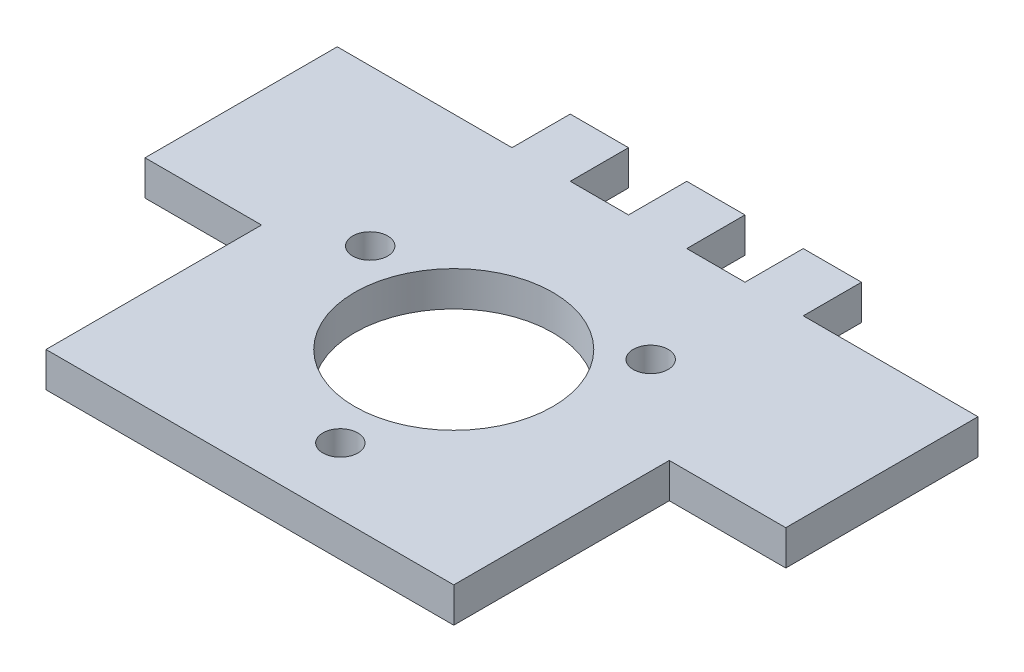
ISO-10303-21;
HEADER;
FILE_DESCRIPTION(('STEP AP214'),'2;1');
FILE_NAME('part.step','',(''),(''),'','','');
FILE_SCHEMA(('AUTOMOTIVE_DESIGN { 1 0 10303 214 1 1 1 1 }'));
ENDSEC;
DATA;
#1=APPLICATION_CONTEXT('core data for automotive mechanical design processes');
#2=APPLICATION_PROTOCOL_DEFINITION('international standard','automotive_design',2000,#1);
#3=PRODUCT_CONTEXT('',#1,'mechanical');
#4=PRODUCT('Part','Part','',(#3));
#5=PRODUCT_RELATED_PRODUCT_CATEGORY('part','',(#4));
#6=PRODUCT_DEFINITION_FORMATION('','',#4);
#7=PRODUCT_DEFINITION_CONTEXT('part definition',#1,'design');
#8=PRODUCT_DEFINITION('design','',#6,#7);
#9=PRODUCT_DEFINITION_SHAPE('','',#8);
#10=(LENGTH_UNIT() NAMED_UNIT(*) SI_UNIT(.MILLI.,.METRE.));
#11=(NAMED_UNIT(*) PLANE_ANGLE_UNIT() SI_UNIT($,.RADIAN.));
#12=(NAMED_UNIT(*) SI_UNIT($,.STERADIAN.) SOLID_ANGLE_UNIT());
#13=UNCERTAINTY_MEASURE_WITH_UNIT(LENGTH_MEASURE(1.E-05),#10,'distance_accuracy_value','');
#14=(GEOMETRIC_REPRESENTATION_CONTEXT(3) GLOBAL_UNCERTAINTY_ASSIGNED_CONTEXT((#13)) GLOBAL_UNIT_ASSIGNED_CONTEXT((#10,
#11,#12)) REPRESENTATION_CONTEXT('',''));
#15=CARTESIAN_POINT('',(0.,0.,0.));
#16=DIRECTION('',(0.,0.,1.));
#17=DIRECTION('',(1.,0.,0.));
#18=AXIS2_PLACEMENT_3D('',#15,#16,#17);
#19=CARTESIAN_POINT('',(-17.5,3.,-17.5));
#20=DIRECTION('',(1.,0.,0.));
#21=DIRECTION('',(0.,0.,-1.));
#22=AXIS2_PLACEMENT_3D('',#19,#20,#21);
#23=PLANE('',#22);
#24=DIRECTION('',(0.,1.,0.));
#25=VECTOR('',#24,1.);
#26=CARTESIAN_POINT('',(-17.5,-19.2937813815747,-0.999999999999997));
#27=LINE('',#26,#25);
#28=CARTESIAN_POINT('',(-17.5,0.,-0.999999999999997));
#29=VERTEX_POINT('',#28);
#30=CARTESIAN_POINT('',(-17.5,3.,-0.999999999999997));
#31=VERTEX_POINT('',#30);
#32=EDGE_CURVE('E57',#29,#31,#27,.T.);
#33=ORIENTED_EDGE('',*,*,#32,.F.);
#34=DIRECTION('',(0.,0.,1.));
#35=VECTOR('',#34,1.);
#36=CARTESIAN_POINT('',(-17.5,0.,-17.5));
#37=LINE('',#36,#35);
#38=CARTESIAN_POINT('',(-17.5,0.,17.5));
#39=VERTEX_POINT('',#38);
#40=EDGE_CURVE('E293',#29,#39,#37,.T.);
#41=ORIENTED_EDGE('',*,*,#40,.T.);
#42=DIRECTION('',(0.,-1.,0.));
#43=VECTOR('',#42,1.);
#44=CARTESIAN_POINT('',(-17.5,3.,17.5));
#45=LINE('',#44,#43);
#46=CARTESIAN_POINT('',(-17.5,3.,17.5));
#47=VERTEX_POINT('',#46);
#48=EDGE_CURVE('E11',#47,#39,#45,.T.);
#49=ORIENTED_EDGE('',*,*,#48,.F.);
#50=DIRECTION('',(0.,0.,1.));
#51=VECTOR('',#50,1.);
#52=CARTESIAN_POINT('',(-17.5,3.,-17.5));
#53=LINE('',#52,#51);
#54=EDGE_CURVE('E219',#31,#47,#53,.T.);
#55=ORIENTED_EDGE('',*,*,#54,.F.);
#56=EDGE_LOOP('',(#33,#41,#49,#55));
#57=FACE_BOUND('',#56,.T.);
#58=ADVANCED_FACE('F33',(#57),#23,.F.);
#59=CARTESIAN_POINT('',(-17.5,3.,-17.5));
#60=DIRECTION('',(0.,0.,1.));
#61=DIRECTION('',(1.,0.,0.));
#62=AXIS2_PLACEMENT_3D('',#59,#60,#61);
#63=PLANE('',#62);
#64=DIRECTION('',(-1.,0.,0.));
#65=VECTOR('',#64,1.);
#66=CARTESIAN_POINT('',(-17.5,3.,-17.5));
#67=LINE('',#66,#65);
#68=CARTESIAN_POINT('',(7.49999999999999,3.,-17.5));
#69=VERTEX_POINT('',#68);
#70=CARTESIAN_POINT('',(2.5,3.,-17.5));
#71=VERTEX_POINT('',#70);
#72=EDGE_CURVE('E258',#69,#71,#67,.T.);
#73=ORIENTED_EDGE('',*,*,#72,.F.);
#74=DIRECTION('',(0.,1.,0.));
#75=VECTOR('',#74,1.);
#76=CARTESIAN_POINT('',(7.49999999999999,0.,-17.5));
#77=LINE('',#76,#75);
#78=CARTESIAN_POINT('',(7.49999999999999,0.,-17.5));
#79=VERTEX_POINT('',#78);
#80=EDGE_CURVE('E378',#79,#69,#77,.T.);
#81=ORIENTED_EDGE('',*,*,#80,.F.);
#82=DIRECTION('',(-1.,0.,0.));
#83=VECTOR('',#82,1.);
#84=CARTESIAN_POINT('',(-17.5,0.,-17.5));
#85=LINE('',#84,#83);
#86=CARTESIAN_POINT('',(2.5,0.,-17.5));
#87=VERTEX_POINT('',#86);
#88=EDGE_CURVE('E253',#79,#87,#85,.T.);
#89=ORIENTED_EDGE('',*,*,#88,.T.);
#90=DIRECTION('',(0.,1.,0.));
#91=VECTOR('',#90,1.);
#92=CARTESIAN_POINT('',(2.49999999999999,0.,-17.5));
#93=LINE('',#92,#91);
#94=EDGE_CURVE('E341',#87,#71,#93,.T.);
#95=ORIENTED_EDGE('',*,*,#94,.T.);
#96=EDGE_LOOP('',(#73,#81,#89,#95));
#97=FACE_BOUND('',#96,.T.);
#98=ADVANCED_FACE('F375',(#97),#63,.F.);
#99=CARTESIAN_POINT('',(-2.50000000000001,3.,-17.5));
#100=VERTEX_POINT('',#99);
#101=CARTESIAN_POINT('',(-7.50000000000001,3.,-17.5));
#102=VERTEX_POINT('',#101);
#103=EDGE_CURVE('E256',#100,#102,#67,.T.);
#104=ORIENTED_EDGE('',*,*,#103,.F.);
#105=DIRECTION('',(0.,1.,0.));
#106=VECTOR('',#105,1.);
#107=CARTESIAN_POINT('',(-2.50000000000001,0.,-17.5));
#108=LINE('',#107,#106);
#109=CARTESIAN_POINT('',(-2.50000000000001,0.,-17.5));
#110=VERTEX_POINT('',#109);
#111=EDGE_CURVE('E348',#110,#100,#108,.T.);
#112=ORIENTED_EDGE('',*,*,#111,.F.);
#113=CARTESIAN_POINT('',(-7.50000000000001,0.,-17.5));
#114=VERTEX_POINT('',#113);
#115=EDGE_CURVE('E250',#110,#114,#85,.T.);
#116=ORIENTED_EDGE('',*,*,#115,.T.);
#117=DIRECTION('',(0.,1.,0.));
#118=VECTOR('',#117,1.);
#119=CARTESIAN_POINT('',(-7.50000000000001,0.,-17.5));
#120=LINE('',#119,#118);
#121=EDGE_CURVE('E303',#114,#102,#120,.T.);
#122=ORIENTED_EDGE('',*,*,#121,.T.);
#123=EDGE_LOOP('',(#104,#112,#116,#122));
#124=FACE_BOUND('',#123,.T.);
#125=ADVANCED_FACE('F418',(#124),#63,.F.);
#126=DIRECTION('',(0.,1.,0.));
#127=VECTOR('',#126,1.);
#128=CARTESIAN_POINT('',(-12.5,0.,-17.5));
#129=LINE('',#128,#127);
#130=CARTESIAN_POINT('',(-12.5,0.,-17.5));
#131=VERTEX_POINT('',#130);
#132=CARTESIAN_POINT('',(-12.5,3.,-17.5));
#133=VERTEX_POINT('',#132);
#134=EDGE_CURVE('E316',#131,#133,#129,.T.);
#135=ORIENTED_EDGE('',*,*,#134,.F.);
#136=CARTESIAN_POINT('',(-27.5,0.,-17.5));
#137=VERTEX_POINT('',#136);
#138=EDGE_CURVE('E233',#131,#137,#85,.T.);
#139=ORIENTED_EDGE('',*,*,#138,.T.);
#140=DIRECTION('',(0.,1.,0.));
#141=VECTOR('',#140,1.);
#142=CARTESIAN_POINT('',(-27.5,-19.2937813815747,-17.5));
#143=LINE('',#142,#141);
#144=CARTESIAN_POINT('',(-27.5,3.,-17.5));
#145=VERTEX_POINT('',#144);
#146=EDGE_CURVE('E224',#137,#145,#143,.T.);
#147=ORIENTED_EDGE('',*,*,#146,.T.);
#148=EDGE_CURVE('E259',#133,#145,#67,.T.);
#149=ORIENTED_EDGE('',*,*,#148,.F.);
#150=EDGE_LOOP('',(#135,#139,#147,#149));
#151=FACE_BOUND('',#150,.T.);
#152=ADVANCED_FACE('F362',(#151),#63,.F.);
#153=CARTESIAN_POINT('',(-17.5,3.,17.5));
#154=DIRECTION('',(0.,0.,-1.));
#155=DIRECTION('',(-1.,0.,0.));
#156=AXIS2_PLACEMENT_3D('',#153,#154,#155);
#157=PLANE('',#156);
#158=DIRECTION('',(1.,0.,0.));
#159=VECTOR('',#158,1.);
#160=CARTESIAN_POINT('',(-17.5,0.,17.5));
#161=LINE('',#160,#159);
#162=CARTESIAN_POINT('',(17.5,0.,17.5));
#163=VERTEX_POINT('',#162);
#164=EDGE_CURVE('E234',#39,#163,#161,.T.);
#165=ORIENTED_EDGE('',*,*,#164,.T.);
#166=DIRECTION('',(0.,-1.,0.));
#167=VECTOR('',#166,1.);
#168=CARTESIAN_POINT('',(17.5,3.,17.5));
#169=LINE('',#168,#167);
#170=CARTESIAN_POINT('',(17.5,3.,17.5));
#171=VERTEX_POINT('',#170);
#172=EDGE_CURVE('E41',#171,#163,#169,.T.);
#173=ORIENTED_EDGE('',*,*,#172,.F.);
#174=DIRECTION('',(1.,0.,0.));
#175=VECTOR('',#174,1.);
#176=CARTESIAN_POINT('',(-17.5,3.,17.5));
#177=LINE('',#176,#175);
#178=EDGE_CURVE('E366',#47,#171,#177,.T.);
#179=ORIENTED_EDGE('',*,*,#178,.F.);
#180=ORIENTED_EDGE('',*,*,#48,.T.);
#181=EDGE_LOOP('',(#165,#173,#179,#180));
#182=FACE_BOUND('',#181,.T.);
#183=ADVANCED_FACE('F435',(#182),#157,.F.);
#184=CARTESIAN_POINT('',(17.5,3.,-17.5));
#185=DIRECTION('',(-1.,0.,0.));
#186=DIRECTION('',(0.,0.,1.));
#187=AXIS2_PLACEMENT_3D('',#184,#185,#186);
#188=PLANE('',#187);
#189=DIRECTION('',(0.,0.,-1.));
#190=VECTOR('',#189,1.);
#191=CARTESIAN_POINT('',(17.5,0.,-17.5));
#192=LINE('',#191,#190);
#193=CARTESIAN_POINT('',(17.5,0.,-0.999999999999997));
#194=VERTEX_POINT('',#193);
#195=EDGE_CURVE('E230',#163,#194,#192,.T.);
#196=ORIENTED_EDGE('',*,*,#195,.T.);
#197=DIRECTION('',(0.,1.,0.));
#198=VECTOR('',#197,1.);
#199=CARTESIAN_POINT('',(17.5,-19.2937813815747,-0.999999999999997));
#200=LINE('',#199,#198);
#201=CARTESIAN_POINT('',(17.5,3.,-0.999999999999997));
#202=VERTEX_POINT('',#201);
#203=EDGE_CURVE('E178',#194,#202,#200,.T.);
#204=ORIENTED_EDGE('',*,*,#203,.T.);
#205=DIRECTION('',(0.,0.,-1.));
#206=VECTOR('',#205,1.);
#207=CARTESIAN_POINT('',(17.5,3.,-17.5));
#208=LINE('',#207,#206);
#209=EDGE_CURVE('E191',#171,#202,#208,.T.);
#210=ORIENTED_EDGE('',*,*,#209,.F.);
#211=ORIENTED_EDGE('',*,*,#172,.T.);
#212=EDGE_LOOP('',(#196,#204,#210,#211));
#213=FACE_BOUND('',#212,.T.);
#214=ADVANCED_FACE('F428',(#213),#188,.F.);
#215=CARTESIAN_POINT('',(27.5,0.,-17.5));
#216=VERTEX_POINT('',#215);
#217=CARTESIAN_POINT('',(12.5,0.,-17.5));
#218=VERTEX_POINT('',#217);
#219=EDGE_CURVE('E248',#216,#218,#85,.T.);
#220=ORIENTED_EDGE('',*,*,#219,.T.);
#221=DIRECTION('',(0.,1.,0.));
#222=VECTOR('',#221,1.);
#223=CARTESIAN_POINT('',(12.5,0.,-17.5));
#224=LINE('',#223,#222);
#225=CARTESIAN_POINT('',(12.5,3.,-17.5));
#226=VERTEX_POINT('',#225);
#227=EDGE_CURVE('E450',#218,#226,#224,.T.);
#228=ORIENTED_EDGE('',*,*,#227,.T.);
#229=CARTESIAN_POINT('',(27.5,3.,-17.5));
#230=VERTEX_POINT('',#229);
#231=EDGE_CURVE('E270',#230,#226,#67,.T.);
#232=ORIENTED_EDGE('',*,*,#231,.F.);
#233=DIRECTION('',(0.,1.,0.));
#234=VECTOR('',#233,1.);
#235=CARTESIAN_POINT('',(27.5,-19.2937813815747,-17.5));
#236=LINE('',#235,#234);
#237=EDGE_CURVE('E177',#216,#230,#236,.T.);
#238=ORIENTED_EDGE('',*,*,#237,.F.);
#239=EDGE_LOOP('',(#220,#228,#232,#238));
#240=FACE_BOUND('',#239,.T.);
#241=ADVANCED_FACE('F420',(#240),#63,.F.);
#242=CARTESIAN_POINT('',(0.,3.,0.));
#243=DIRECTION('',(0.,1.,0.));
#244=DIRECTION('',(0.,0.,1.));
#245=AXIS2_PLACEMENT_3D('',#242,#243,#244);
#246=PLANE('',#245);
#247=CARTESIAN_POINT('',(9.19253331742836,3.,-7.71345131623812));
#248=DIRECTION('',(0.,1.,0.));
#249=DIRECTION('',(0.,0.,1.));
#250=AXIS2_PLACEMENT_3D('',#247,#248,#249);
#251=CIRCLE('',#250,1.5);
#252=CARTESIAN_POINT('',(9.19253331742836,3.,-6.21345131623812));
#253=VERTEX_POINT('',#252);
#254=EDGE_CURVE('E228',#253,#253,#251,.T.);
#255=ORIENTED_EDGE('',*,*,#254,.F.);
#256=EDGE_LOOP('',(#255));
#257=FACE_BOUND('',#256,.T.);
#258=CARTESIAN_POINT('',(-11.2763114494303,3.,-4.10424171990838));
#259=DIRECTION('',(0.,1.,0.));
#260=DIRECTION('',(0.,0.,1.));
#261=AXIS2_PLACEMENT_3D('',#258,#259,#260);
#262=CIRCLE('',#261,1.5);
#263=CARTESIAN_POINT('',(-11.2763114494303,3.,-2.60424171990838));
#264=VERTEX_POINT('',#263);
#265=EDGE_CURVE('E290',#264,#264,#262,.T.);
#266=ORIENTED_EDGE('',*,*,#265,.F.);
#267=EDGE_LOOP('',(#266));
#268=FACE_BOUND('',#267,.T.);
#269=CARTESIAN_POINT('',(2.08377813200318,3.,11.8176930361465));
#270=DIRECTION('',(0.,1.,0.));
#271=DIRECTION('',(0.,0.,1.));
#272=AXIS2_PLACEMENT_3D('',#269,#270,#271);
#273=CIRCLE('',#272,1.5);
#274=CARTESIAN_POINT('',(2.08377813200318,3.,13.3176930361465));
#275=VERTEX_POINT('',#274);
#276=EDGE_CURVE('E286',#275,#275,#273,.T.);
#277=ORIENTED_EDGE('',*,*,#276,.F.);
#278=EDGE_LOOP('',(#277));
#279=FACE_BOUND('',#278,.T.);
#280=CARTESIAN_POINT('',(0.,3.,0.));
#281=DIRECTION('',(0.,1.,0.));
#282=DIRECTION('',(0.,0.,1.));
#283=AXIS2_PLACEMENT_3D('',#280,#281,#282);
#284=CIRCLE('',#283,8.5);
#285=CARTESIAN_POINT('',(0.,3.,8.5));
#286=VERTEX_POINT('',#285);
#287=EDGE_CURVE('E282',#286,#286,#284,.T.);
#288=ORIENTED_EDGE('',*,*,#287,.F.);
#289=EDGE_LOOP('',(#288));
#290=FACE_BOUND('',#289,.T.);
#291=ORIENTED_EDGE('',*,*,#148,.T.);
#292=DIRECTION('',(0.,0.,1.));
#293=VECTOR('',#292,1.);
#294=CARTESIAN_POINT('',(-27.5,3.,-17.5));
#295=LINE('',#294,#293);
#296=CARTESIAN_POINT('',(-27.5,3.,-0.999999999999996));
#297=VERTEX_POINT('',#296);
#298=EDGE_CURVE('E207',#145,#297,#295,.T.);
#299=ORIENTED_EDGE('',*,*,#298,.T.);
#300=DIRECTION('',(1.,0.,0.));
#301=VECTOR('',#300,1.);
#302=CARTESIAN_POINT('',(-17.5,3.,-0.999999999999997));
#303=LINE('',#302,#301);
#304=EDGE_CURVE('E210',#297,#31,#303,.T.);
#305=ORIENTED_EDGE('',*,*,#304,.T.);
#306=ORIENTED_EDGE('',*,*,#54,.T.);
#307=ORIENTED_EDGE('',*,*,#178,.T.);
#308=ORIENTED_EDGE('',*,*,#209,.T.);
#309=DIRECTION('',(-1.,0.,0.));
#310=VECTOR('',#309,1.);
#311=CARTESIAN_POINT('',(17.5,3.,-0.999999999999997));
#312=LINE('',#311,#310);
#313=CARTESIAN_POINT('',(27.5,3.,-0.999999999999996));
#314=VERTEX_POINT('',#313);
#315=EDGE_CURVE('E49',#314,#202,#312,.T.);
#316=ORIENTED_EDGE('',*,*,#315,.F.);
#317=DIRECTION('',(0.,0.,1.));
#318=VECTOR('',#317,1.);
#319=CARTESIAN_POINT('',(27.5,3.,-17.5));
#320=LINE('',#319,#318);
#321=EDGE_CURVE('E182',#230,#314,#320,.T.);
#322=ORIENTED_EDGE('',*,*,#321,.F.);
#323=ORIENTED_EDGE('',*,*,#231,.T.);
#324=DIRECTION('',(0.,0.,-1.));
#325=VECTOR('',#324,1.);
#326=CARTESIAN_POINT('',(12.5,3.,-17.5));
#327=LINE('',#326,#325);
#328=CARTESIAN_POINT('',(12.5,3.,-22.5));
#329=VERTEX_POINT('',#328);
#330=EDGE_CURVE('E462',#226,#329,#327,.T.);
#331=ORIENTED_EDGE('',*,*,#330,.T.);
#332=DIRECTION('',(-1.,0.,0.));
#333=VECTOR('',#332,1.);
#334=CARTESIAN_POINT('',(7.49999999999999,3.,-22.5));
#335=LINE('',#334,#333);
#336=CARTESIAN_POINT('',(7.49999999999999,3.,-22.5));
#337=VERTEX_POINT('',#336);
#338=EDGE_CURVE('E458',#329,#337,#335,.T.);
#339=ORIENTED_EDGE('',*,*,#338,.T.);
#340=DIRECTION('',(0.,0.,1.));
#341=VECTOR('',#340,1.);
#342=CARTESIAN_POINT('',(7.49999999999999,3.,-17.5));
#343=LINE('',#342,#341);
#344=EDGE_CURVE('E281',#337,#69,#343,.T.);
#345=ORIENTED_EDGE('',*,*,#344,.T.);
#346=ORIENTED_EDGE('',*,*,#72,.T.);
#347=DIRECTION('',(0.,0.,-1.));
#348=VECTOR('',#347,1.);
#349=CARTESIAN_POINT('',(2.49999999999999,3.,-17.5));
#350=LINE('',#349,#348);
#351=CARTESIAN_POINT('',(2.49999999999999,3.,-22.5));
#352=VERTEX_POINT('',#351);
#353=EDGE_CURVE('E387',#71,#352,#350,.T.);
#354=ORIENTED_EDGE('',*,*,#353,.T.);
#355=DIRECTION('',(-1.,0.,0.));
#356=VECTOR('',#355,1.);
#357=CARTESIAN_POINT('',(-2.50000000000001,3.,-22.5));
#358=LINE('',#357,#356);
#359=CARTESIAN_POINT('',(-2.50000000000001,3.,-22.5));
#360=VERTEX_POINT('',#359);
#361=EDGE_CURVE('E344',#352,#360,#358,.T.);
#362=ORIENTED_EDGE('',*,*,#361,.T.);
#363=DIRECTION('',(0.,0.,1.));
#364=VECTOR('',#363,1.);
#365=CARTESIAN_POINT('',(-2.50000000000001,3.,-17.5));
#366=LINE('',#365,#364);
#367=EDGE_CURVE('E396',#360,#100,#366,.T.);
#368=ORIENTED_EDGE('',*,*,#367,.T.);
#369=ORIENTED_EDGE('',*,*,#103,.T.);
#370=DIRECTION('',(0.,0.,-1.));
#371=VECTOR('',#370,1.);
#372=CARTESIAN_POINT('',(-7.50000000000001,3.,-17.5));
#373=LINE('',#372,#371);
#374=CARTESIAN_POINT('',(-7.50000000000001,3.,-22.5));
#375=VERTEX_POINT('',#374);
#376=EDGE_CURVE('E330',#102,#375,#373,.T.);
#377=ORIENTED_EDGE('',*,*,#376,.T.);
#378=DIRECTION('',(-1.,0.,0.));
#379=VECTOR('',#378,1.);
#380=CARTESIAN_POINT('',(-12.5,3.,-22.5));
#381=LINE('',#380,#379);
#382=CARTESIAN_POINT('',(-12.5,3.,-22.5));
#383=VERTEX_POINT('',#382);
#384=EDGE_CURVE('E306',#375,#383,#381,.T.);
#385=ORIENTED_EDGE('',*,*,#384,.T.);
#386=DIRECTION('',(0.,0.,1.));
#387=VECTOR('',#386,1.);
#388=CARTESIAN_POINT('',(-12.5,3.,-17.5));
#389=LINE('',#388,#387);
#390=EDGE_CURVE('E328',#383,#133,#389,.T.);
#391=ORIENTED_EDGE('',*,*,#390,.T.);
#392=EDGE_LOOP('',(#291,#299,#305,#306,#307,#308,#316,#322,#323,#331,#339,#345,#346,#354,#362,
#368,#369,#377,#385,#391));
#393=FACE_BOUND('',#392,.T.);
#394=ADVANCED_FACE('F189',(#257,#268,#279,#290,#393),#246,.T.);
#395=CARTESIAN_POINT('',(0.,0.,0.));
#396=DIRECTION('',(0.,1.,0.));
#397=DIRECTION('',(0.,0.,1.));
#398=AXIS2_PLACEMENT_3D('',#395,#396,#397);
#399=PLANE('',#398);
#400=CARTESIAN_POINT('',(9.19253331742836,0.,-7.71345131623812));
#401=DIRECTION('',(0.,1.,0.));
#402=DIRECTION('',(0.,0.,1.));
#403=AXIS2_PLACEMENT_3D('',#400,#401,#402);
#404=CIRCLE('',#403,1.5);
#405=CARTESIAN_POINT('',(9.19253331742836,0.,-6.21345131623812));
#406=VERTEX_POINT('',#405);
#407=EDGE_CURVE('E291',#406,#406,#404,.T.);
#408=ORIENTED_EDGE('',*,*,#407,.T.);
#409=EDGE_LOOP('',(#408));
#410=FACE_BOUND('',#409,.T.);
#411=CARTESIAN_POINT('',(-11.2763114494303,0.,-4.10424171990838));
#412=DIRECTION('',(0.,1.,0.));
#413=DIRECTION('',(0.,0.,1.));
#414=AXIS2_PLACEMENT_3D('',#411,#412,#413);
#415=CIRCLE('',#414,1.5);
#416=CARTESIAN_POINT('',(-11.2763114494303,0.,-2.60424171990838));
#417=VERTEX_POINT('',#416);
#418=EDGE_CURVE('E287',#417,#417,#415,.T.);
#419=ORIENTED_EDGE('',*,*,#418,.T.);
#420=EDGE_LOOP('',(#419));
#421=FACE_BOUND('',#420,.T.);
#422=CARTESIAN_POINT('',(2.08377813200318,0.,11.8176930361465));
#423=DIRECTION('',(0.,1.,0.));
#424=DIRECTION('',(0.,0.,1.));
#425=AXIS2_PLACEMENT_3D('',#422,#423,#424);
#426=CIRCLE('',#425,1.5);
#427=CARTESIAN_POINT('',(2.08377813200318,0.,13.3176930361465));
#428=VERTEX_POINT('',#427);
#429=EDGE_CURVE('E283',#428,#428,#426,.T.);
#430=ORIENTED_EDGE('',*,*,#429,.T.);
#431=EDGE_LOOP('',(#430));
#432=FACE_BOUND('',#431,.T.);
#433=CARTESIAN_POINT('',(0.,0.,0.));
#434=DIRECTION('',(0.,1.,0.));
#435=DIRECTION('',(0.,0.,1.));
#436=AXIS2_PLACEMENT_3D('',#433,#434,#435);
#437=CIRCLE('',#436,8.5);
#438=CARTESIAN_POINT('',(0.,0.,8.5));
#439=VERTEX_POINT('',#438);
#440=EDGE_CURVE('E278',#439,#439,#437,.T.);
#441=ORIENTED_EDGE('',*,*,#440,.T.);
#442=EDGE_LOOP('',(#441));
#443=FACE_BOUND('',#442,.T.);
#444=ORIENTED_EDGE('',*,*,#40,.F.);
#445=DIRECTION('',(-1.,0.,0.));
#446=VECTOR('',#445,1.);
#447=CARTESIAN_POINT('',(-17.5,0.,-0.999999999999997));
#448=LINE('',#447,#446);
#449=CARTESIAN_POINT('',(-27.5,0.,-0.999999999999997));
#450=VERTEX_POINT('',#449);
#451=EDGE_CURVE('E206',#29,#450,#448,.T.);
#452=ORIENTED_EDGE('',*,*,#451,.T.);
#453=DIRECTION('',(0.,0.,-1.));
#454=VECTOR('',#453,1.);
#455=CARTESIAN_POINT('',(-27.5,0.,-17.5));
#456=LINE('',#455,#454);
#457=EDGE_CURVE('E203',#450,#137,#456,.T.);
#458=ORIENTED_EDGE('',*,*,#457,.T.);
#459=ORIENTED_EDGE('',*,*,#138,.F.);
#460=DIRECTION('',(0.,0.,1.));
#461=VECTOR('',#460,1.);
#462=CARTESIAN_POINT('',(-12.5,0.,-17.5));
#463=LINE('',#462,#461);
#464=CARTESIAN_POINT('',(-12.5,0.,-22.5));
#465=VERTEX_POINT('',#464);
#466=EDGE_CURVE('E322',#465,#131,#463,.T.);
#467=ORIENTED_EDGE('',*,*,#466,.F.);
#468=DIRECTION('',(-1.,0.,0.));
#469=VECTOR('',#468,1.);
#470=CARTESIAN_POINT('',(-12.5,0.,-22.5));
#471=LINE('',#470,#469);
#472=CARTESIAN_POINT('',(-7.50000000000001,0.,-22.5));
#473=VERTEX_POINT('',#472);
#474=EDGE_CURVE('E321',#473,#465,#471,.T.);
#475=ORIENTED_EDGE('',*,*,#474,.F.);
#476=DIRECTION('',(0.,0.,-1.));
#477=VECTOR('',#476,1.);
#478=CARTESIAN_POINT('',(-7.50000000000001,0.,-17.5));
#479=LINE('',#478,#477);
#480=EDGE_CURVE('E318',#114,#473,#479,.T.);
#481=ORIENTED_EDGE('',*,*,#480,.F.);
#482=ORIENTED_EDGE('',*,*,#115,.F.);
#483=DIRECTION('',(0.,0.,1.));
#484=VECTOR('',#483,1.);
#485=CARTESIAN_POINT('',(-2.50000000000001,0.,-17.5));
#486=LINE('',#485,#484);
#487=CARTESIAN_POINT('',(-2.50000000000001,0.,-22.5));
#488=VERTEX_POINT('',#487);
#489=EDGE_CURVE('E389',#488,#110,#486,.T.);
#490=ORIENTED_EDGE('',*,*,#489,.F.);
#491=DIRECTION('',(-1.,0.,0.));
#492=VECTOR('',#491,1.);
#493=CARTESIAN_POINT('',(-2.50000000000001,0.,-22.5));
#494=LINE('',#493,#492);
#495=CARTESIAN_POINT('',(2.49999999999999,0.,-22.5));
#496=VERTEX_POINT('',#495);
#497=EDGE_CURVE('E350',#496,#488,#494,.T.);
#498=ORIENTED_EDGE('',*,*,#497,.F.);
#499=DIRECTION('',(0.,0.,-1.));
#500=VECTOR('',#499,1.);
#501=CARTESIAN_POINT('',(2.49999999999999,0.,-17.5));
#502=LINE('',#501,#500);
#503=EDGE_CURVE('E385',#87,#496,#502,.T.);
#504=ORIENTED_EDGE('',*,*,#503,.F.);
#505=ORIENTED_EDGE('',*,*,#88,.F.);
#506=DIRECTION('',(0.,0.,1.));
#507=VECTOR('',#506,1.);
#508=CARTESIAN_POINT('',(7.49999999999999,0.,-17.5));
#509=LINE('',#508,#507);
#510=CARTESIAN_POINT('',(7.49999999999999,0.,-22.5));
#511=VERTEX_POINT('',#510);
#512=EDGE_CURVE('E461',#511,#79,#509,.T.);
#513=ORIENTED_EDGE('',*,*,#512,.F.);
#514=DIRECTION('',(-1.,0.,0.));
#515=VECTOR('',#514,1.);
#516=CARTESIAN_POINT('',(7.49999999999999,0.,-22.5));
#517=LINE('',#516,#515);
#518=CARTESIAN_POINT('',(12.5,0.,-22.5));
#519=VERTEX_POINT('',#518);
#520=EDGE_CURVE('E455',#519,#511,#517,.T.);
#521=ORIENTED_EDGE('',*,*,#520,.F.);
#522=DIRECTION('',(0.,0.,-1.));
#523=VECTOR('',#522,1.);
#524=CARTESIAN_POINT('',(12.5,0.,-17.5));
#525=LINE('',#524,#523);
#526=EDGE_CURVE('E449',#218,#519,#525,.T.);
#527=ORIENTED_EDGE('',*,*,#526,.F.);
#528=ORIENTED_EDGE('',*,*,#219,.F.);
#529=DIRECTION('',(0.,0.,-1.));
#530=VECTOR('',#529,1.);
#531=CARTESIAN_POINT('',(27.5,0.,-17.5));
#532=LINE('',#531,#530);
#533=CARTESIAN_POINT('',(27.5,0.,-0.999999999999996));
#534=VERTEX_POINT('',#533);
#535=EDGE_CURVE('E211',#534,#216,#532,.T.);
#536=ORIENTED_EDGE('',*,*,#535,.F.);
#537=DIRECTION('',(1.,0.,0.));
#538=VECTOR('',#537,1.);
#539=CARTESIAN_POINT('',(17.5,0.,-0.999999999999997));
#540=LINE('',#539,#538);
#541=EDGE_CURVE('E174',#194,#534,#540,.T.);
#542=ORIENTED_EDGE('',*,*,#541,.F.);
#543=ORIENTED_EDGE('',*,*,#195,.F.);
#544=ORIENTED_EDGE('',*,*,#164,.F.);
#545=EDGE_LOOP('',(#444,#452,#458,#459,#467,#475,#481,#482,#490,#498,#504,#505,#513,#521,#527,
#528,#536,#542,#543,#544));
#546=FACE_BOUND('',#545,.T.);
#547=ADVANCED_FACE('F356',(#410,#421,#432,#443,#546),#399,.F.);
#548=CARTESIAN_POINT('',(-12.5,0.,-17.5));
#549=DIRECTION('',(-1.,0.,0.));
#550=DIRECTION('',(0.,0.,1.));
#551=AXIS2_PLACEMENT_3D('',#548,#549,#550);
#552=PLANE('',#551);
#553=ORIENTED_EDGE('',*,*,#390,.F.);
#554=DIRECTION('',(0.,1.,0.));
#555=VECTOR('',#554,1.);
#556=CARTESIAN_POINT('',(-12.5,0.,-22.5));
#557=LINE('',#556,#555);
#558=EDGE_CURVE('E294',#465,#383,#557,.T.);
#559=ORIENTED_EDGE('',*,*,#558,.F.);
#560=ORIENTED_EDGE('',*,*,#466,.T.);
#561=ORIENTED_EDGE('',*,*,#134,.T.);
#562=EDGE_LOOP('',(#553,#559,#560,#561));
#563=FACE_BOUND('',#562,.T.);
#564=ADVANCED_FACE('F360',(#563),#552,.T.);
#565=CARTESIAN_POINT('',(-12.5,0.,-22.5));
#566=DIRECTION('',(0.,0.,-1.));
#567=DIRECTION('',(-1.,0.,0.));
#568=AXIS2_PLACEMENT_3D('',#565,#566,#567);
#569=PLANE('',#568);
#570=ORIENTED_EDGE('',*,*,#384,.F.);
#571=DIRECTION('',(0.,1.,0.));
#572=VECTOR('',#571,1.);
#573=CARTESIAN_POINT('',(-7.50000000000001,0.,-22.5));
#574=LINE('',#573,#572);
#575=EDGE_CURVE('E297',#473,#375,#574,.T.);
#576=ORIENTED_EDGE('',*,*,#575,.F.);
#577=ORIENTED_EDGE('',*,*,#474,.T.);
#578=ORIENTED_EDGE('',*,*,#558,.T.);
#579=EDGE_LOOP('',(#570,#576,#577,#578));
#580=FACE_BOUND('',#579,.T.);
#581=ADVANCED_FACE('F352',(#580),#569,.T.);
#582=CARTESIAN_POINT('',(-7.50000000000001,0.,-17.5));
#583=DIRECTION('',(1.,0.,0.));
#584=DIRECTION('',(0.,0.,-1.));
#585=AXIS2_PLACEMENT_3D('',#582,#583,#584);
#586=PLANE('',#585);
#587=ORIENTED_EDGE('',*,*,#376,.F.);
#588=ORIENTED_EDGE('',*,*,#121,.F.);
#589=ORIENTED_EDGE('',*,*,#480,.T.);
#590=ORIENTED_EDGE('',*,*,#575,.T.);
#591=EDGE_LOOP('',(#587,#588,#589,#590));
#592=FACE_BOUND('',#591,.T.);
#593=ADVANCED_FACE('F410',(#592),#586,.T.);
#594=CARTESIAN_POINT('',(-2.50000000000001,0.,-17.5));
#595=DIRECTION('',(-1.,0.,0.));
#596=DIRECTION('',(0.,0.,1.));
#597=AXIS2_PLACEMENT_3D('',#594,#595,#596);
#598=PLANE('',#597);
#599=ORIENTED_EDGE('',*,*,#367,.F.);
#600=DIRECTION('',(0.,1.,0.));
#601=VECTOR('',#600,1.);
#602=CARTESIAN_POINT('',(-2.50000000000001,0.,-22.5));
#603=LINE('',#602,#601);
#604=EDGE_CURVE('E331',#488,#360,#603,.T.);
#605=ORIENTED_EDGE('',*,*,#604,.F.);
#606=ORIENTED_EDGE('',*,*,#489,.T.);
#607=ORIENTED_EDGE('',*,*,#111,.T.);
#608=EDGE_LOOP('',(#599,#605,#606,#607));
#609=FACE_BOUND('',#608,.T.);
#610=ADVANCED_FACE('F402',(#609),#598,.T.);
#611=CARTESIAN_POINT('',(-2.50000000000001,0.,-22.5));
#612=DIRECTION('',(0.,0.,-1.));
#613=DIRECTION('',(-1.,0.,0.));
#614=AXIS2_PLACEMENT_3D('',#611,#612,#613);
#615=PLANE('',#614);
#616=ORIENTED_EDGE('',*,*,#361,.F.);
#617=DIRECTION('',(0.,1.,0.));
#618=VECTOR('',#617,1.);
#619=CARTESIAN_POINT('',(2.49999999999999,0.,-22.5));
#620=LINE('',#619,#618);
#621=EDGE_CURVE('E335',#496,#352,#620,.T.);
#622=ORIENTED_EDGE('',*,*,#621,.F.);
#623=ORIENTED_EDGE('',*,*,#497,.T.);
#624=ORIENTED_EDGE('',*,*,#604,.T.);
#625=EDGE_LOOP('',(#616,#622,#623,#624));
#626=FACE_BOUND('',#625,.T.);
#627=ADVANCED_FACE('F400',(#626),#615,.T.);
#628=CARTESIAN_POINT('',(2.49999999999999,0.,-17.5));
#629=DIRECTION('',(1.,0.,0.));
#630=DIRECTION('',(0.,0.,-1.));
#631=AXIS2_PLACEMENT_3D('',#628,#629,#630);
#632=PLANE('',#631);
#633=ORIENTED_EDGE('',*,*,#353,.F.);
#634=ORIENTED_EDGE('',*,*,#94,.F.);
#635=ORIENTED_EDGE('',*,*,#503,.T.);
#636=ORIENTED_EDGE('',*,*,#621,.T.);
#637=EDGE_LOOP('',(#633,#634,#635,#636));
#638=FACE_BOUND('',#637,.T.);
#639=ADVANCED_FACE('F384',(#638),#632,.T.);
#640=CARTESIAN_POINT('',(7.49999999999999,0.,-17.5));
#641=DIRECTION('',(-1.,0.,0.));
#642=DIRECTION('',(0.,0.,1.));
#643=AXIS2_PLACEMENT_3D('',#640,#641,#642);
#644=PLANE('',#643);
#645=ORIENTED_EDGE('',*,*,#344,.F.);
#646=DIRECTION('',(0.,1.,0.));
#647=VECTOR('',#646,1.);
#648=CARTESIAN_POINT('',(7.49999999999999,0.,-22.5));
#649=LINE('',#648,#647);
#650=EDGE_CURVE('E398',#511,#337,#649,.T.);
#651=ORIENTED_EDGE('',*,*,#650,.F.);
#652=ORIENTED_EDGE('',*,*,#512,.T.);
#653=ORIENTED_EDGE('',*,*,#80,.T.);
#654=EDGE_LOOP('',(#645,#651,#652,#653));
#655=FACE_BOUND('',#654,.T.);
#656=ADVANCED_FACE('F408',(#655),#644,.T.);
#657=CARTESIAN_POINT('',(7.49999999999999,0.,-22.5));
#658=DIRECTION('',(0.,0.,-1.));
#659=DIRECTION('',(-1.,0.,0.));
#660=AXIS2_PLACEMENT_3D('',#657,#658,#659);
#661=PLANE('',#660);
#662=ORIENTED_EDGE('',*,*,#338,.F.);
#663=DIRECTION('',(0.,1.,0.));
#664=VECTOR('',#663,1.);
#665=CARTESIAN_POINT('',(12.5,0.,-22.5));
#666=LINE('',#665,#664);
#667=EDGE_CURVE('E452',#519,#329,#666,.T.);
#668=ORIENTED_EDGE('',*,*,#667,.F.);
#669=ORIENTED_EDGE('',*,*,#520,.T.);
#670=ORIENTED_EDGE('',*,*,#650,.T.);
#671=EDGE_LOOP('',(#662,#668,#669,#670));
#672=FACE_BOUND('',#671,.T.);
#673=ADVANCED_FACE('F510',(#672),#661,.T.);
#674=CARTESIAN_POINT('',(12.5,0.,-17.5));
#675=DIRECTION('',(1.,0.,0.));
#676=DIRECTION('',(0.,0.,-1.));
#677=AXIS2_PLACEMENT_3D('',#674,#675,#676);
#678=PLANE('',#677);
#679=ORIENTED_EDGE('',*,*,#330,.F.);
#680=ORIENTED_EDGE('',*,*,#227,.F.);
#681=ORIENTED_EDGE('',*,*,#526,.T.);
#682=ORIENTED_EDGE('',*,*,#667,.T.);
#683=EDGE_LOOP('',(#679,#680,#681,#682));
#684=FACE_BOUND('',#683,.T.);
#685=ADVANCED_FACE('F508',(#684),#678,.T.);
#686=CARTESIAN_POINT('',(0.,-2.,0.));
#687=DIRECTION('',(0.,1.,0.));
#688=DIRECTION('',(0.,0.,1.));
#689=AXIS2_PLACEMENT_3D('',#686,#687,#688);
#690=CYLINDRICAL_SURFACE('',#689,8.5);
#691=ORIENTED_EDGE('',*,*,#287,.T.);
#692=EDGE_LOOP('',(#691));
#693=FACE_BOUND('',#692,.T.);
#694=ORIENTED_EDGE('',*,*,#440,.F.);
#695=EDGE_LOOP('',(#694));
#696=FACE_BOUND('',#695,.T.);
#697=ADVANCED_FACE('F504',(#693,#696),#690,.F.);
#698=CARTESIAN_POINT('',(2.08377813200318,-2.,11.8176930361465));
#699=DIRECTION('',(0.,1.,0.));
#700=DIRECTION('',(0.,0.,1.));
#701=AXIS2_PLACEMENT_3D('',#698,#699,#700);
#702=CYLINDRICAL_SURFACE('',#701,1.5);
#703=ORIENTED_EDGE('',*,*,#276,.T.);
#704=EDGE_LOOP('',(#703));
#705=FACE_BOUND('',#704,.T.);
#706=ORIENTED_EDGE('',*,*,#429,.F.);
#707=EDGE_LOOP('',(#706));
#708=FACE_BOUND('',#707,.T.);
#709=ADVANCED_FACE('F500',(#705,#708),#702,.F.);
#710=CARTESIAN_POINT('',(-11.2763114494303,-2.,-4.10424171990838));
#711=DIRECTION('',(0.,1.,0.));
#712=DIRECTION('',(0.,0.,1.));
#713=AXIS2_PLACEMENT_3D('',#710,#711,#712);
#714=CYLINDRICAL_SURFACE('',#713,1.5);
#715=ORIENTED_EDGE('',*,*,#265,.T.);
#716=EDGE_LOOP('',(#715));
#717=FACE_BOUND('',#716,.T.);
#718=ORIENTED_EDGE('',*,*,#418,.F.);
#719=EDGE_LOOP('',(#718));
#720=FACE_BOUND('',#719,.T.);
#721=ADVANCED_FACE('F492',(#717,#720),#714,.F.);
#722=CARTESIAN_POINT('',(9.19253331742836,-2.,-7.71345131623812));
#723=DIRECTION('',(0.,1.,0.));
#724=DIRECTION('',(0.,0.,1.));
#725=AXIS2_PLACEMENT_3D('',#722,#723,#724);
#726=CYLINDRICAL_SURFACE('',#725,1.5);
#727=ORIENTED_EDGE('',*,*,#254,.T.);
#728=EDGE_LOOP('',(#727));
#729=FACE_BOUND('',#728,.T.);
#730=ORIENTED_EDGE('',*,*,#407,.F.);
#731=EDGE_LOOP('',(#730));
#732=FACE_BOUND('',#731,.T.);
#733=ADVANCED_FACE('F485',(#729,#732),#726,.F.);
#734=CARTESIAN_POINT('',(-17.5,-19.2937813815747,-0.999999999999997));
#735=DIRECTION('',(0.,0.,1.));
#736=DIRECTION('',(1.,0.,0.));
#737=AXIS2_PLACEMENT_3D('',#734,#735,#736);
#738=PLANE('',#737);
#739=ORIENTED_EDGE('',*,*,#451,.F.);
#740=ORIENTED_EDGE('',*,*,#32,.T.);
#741=ORIENTED_EDGE('',*,*,#304,.F.);
#742=DIRECTION('',(0.,1.,0.));
#743=VECTOR('',#742,1.);
#744=CARTESIAN_POINT('',(-27.5,-19.2937813815747,-0.999999999999996));
#745=LINE('',#744,#743);
#746=EDGE_CURVE('E214',#450,#297,#745,.T.);
#747=ORIENTED_EDGE('',*,*,#746,.F.);
#748=EDGE_LOOP('',(#739,#740,#741,#747));
#749=FACE_BOUND('',#748,.T.);
#750=ADVANCED_FACE('F483',(#749),#738,.T.);
#751=CARTESIAN_POINT('',(-27.5,-19.2937813815747,-17.5));
#752=DIRECTION('',(-1.,0.,0.));
#753=DIRECTION('',(0.,0.,1.));
#754=AXIS2_PLACEMENT_3D('',#751,#752,#753);
#755=PLANE('',#754);
#756=ORIENTED_EDGE('',*,*,#457,.F.);
#757=ORIENTED_EDGE('',*,*,#746,.T.);
#758=ORIENTED_EDGE('',*,*,#298,.F.);
#759=ORIENTED_EDGE('',*,*,#146,.F.);
#760=EDGE_LOOP('',(#756,#757,#758,#759));
#761=FACE_BOUND('',#760,.T.);
#762=ADVANCED_FACE('F479',(#761),#755,.T.);
#763=CARTESIAN_POINT('',(17.5,-19.2937813815747,-0.999999999999997));
#764=DIRECTION('',(0.,0.,-1.));
#765=DIRECTION('',(-1.,0.,0.));
#766=AXIS2_PLACEMENT_3D('',#763,#764,#765);
#767=PLANE('',#766);
#768=ORIENTED_EDGE('',*,*,#203,.F.);
#769=ORIENTED_EDGE('',*,*,#541,.T.);
#770=DIRECTION('',(0.,1.,0.));
#771=VECTOR('',#770,1.);
#772=CARTESIAN_POINT('',(27.5,-19.2937813815747,-0.999999999999996));
#773=LINE('',#772,#771);
#774=EDGE_CURVE('E171',#534,#314,#773,.T.);
#775=ORIENTED_EDGE('',*,*,#774,.T.);
#776=ORIENTED_EDGE('',*,*,#315,.T.);
#777=EDGE_LOOP('',(#768,#769,#775,#776));
#778=FACE_BOUND('',#777,.T.);
#779=ADVANCED_FACE('F173',(#778),#767,.F.);
#780=CARTESIAN_POINT('',(27.5,-19.2937813815747,-17.5));
#781=DIRECTION('',(-1.,0.,0.));
#782=DIRECTION('',(0.,0.,1.));
#783=AXIS2_PLACEMENT_3D('',#780,#781,#782);
#784=PLANE('',#783);
#785=ORIENTED_EDGE('',*,*,#774,.F.);
#786=ORIENTED_EDGE('',*,*,#535,.T.);
#787=ORIENTED_EDGE('',*,*,#237,.T.);
#788=ORIENTED_EDGE('',*,*,#321,.T.);
#789=EDGE_LOOP('',(#785,#786,#787,#788));
#790=FACE_BOUND('',#789,.T.);
#791=ADVANCED_FACE('F183',(#790),#784,.F.);
#792=CLOSED_SHELL('',(#58,#98,#125,#152,#183,#214,#241,#394,#547,#564,#581,#593,#610,#627,#639,
#656,#673,#685,#697,#709,#721,#733,#750,#762,#779,#791));
#793=MANIFOLD_SOLID_BREP('B2',#792);
#794=ADVANCED_BREP_SHAPE_REPRESENTATION('',(#18,#793),#14);
#795=SHAPE_DEFINITION_REPRESENTATION(#9,#794);
ENDSEC;
END-ISO-10303-21;
